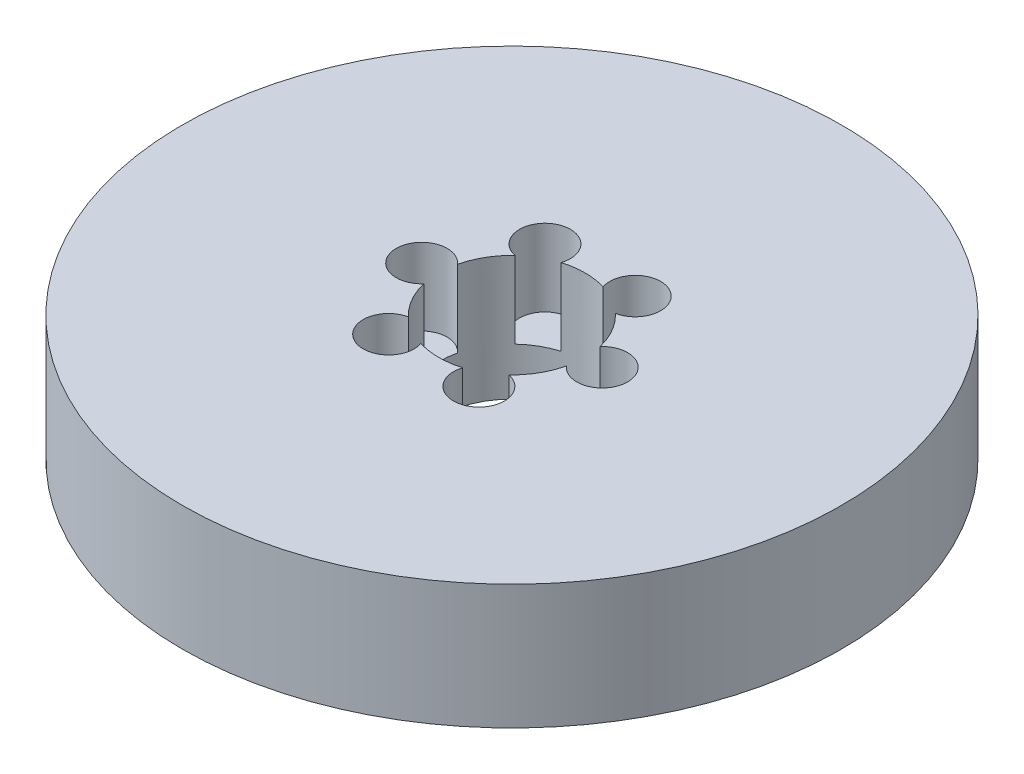
ISO-10303-21;
HEADER;
FILE_DESCRIPTION(('STEP AP214'),'2;1');
FILE_NAME('part.step','',(''),(''),'','','');
FILE_SCHEMA(('AUTOMOTIVE_DESIGN { 1 0 10303 214 1 1 1 1 }'));
ENDSEC;
DATA;
#1=APPLICATION_CONTEXT('core data for automotive mechanical design processes');
#2=APPLICATION_PROTOCOL_DEFINITION('international standard','automotive_design',2000,#1);
#3=PRODUCT_CONTEXT('',#1,'mechanical');
#4=PRODUCT('Part','Part','',(#3));
#5=PRODUCT_RELATED_PRODUCT_CATEGORY('part','',(#4));
#6=PRODUCT_DEFINITION_FORMATION('','',#4);
#7=PRODUCT_DEFINITION_CONTEXT('part definition',#1,'design');
#8=PRODUCT_DEFINITION('design','',#6,#7);
#9=PRODUCT_DEFINITION_SHAPE('','',#8);
#10=(LENGTH_UNIT() NAMED_UNIT(*) SI_UNIT(.MILLI.,.METRE.));
#11=(NAMED_UNIT(*) PLANE_ANGLE_UNIT() SI_UNIT($,.RADIAN.));
#12=(NAMED_UNIT(*) SI_UNIT($,.STERADIAN.) SOLID_ANGLE_UNIT());
#13=UNCERTAINTY_MEASURE_WITH_UNIT(LENGTH_MEASURE(1.E-05),#10,'distance_accuracy_value','');
#14=(GEOMETRIC_REPRESENTATION_CONTEXT(3) GLOBAL_UNCERTAINTY_ASSIGNED_CONTEXT((#13)) GLOBAL_UNIT_ASSIGNED_CONTEXT((#10,
#11,#12)) REPRESENTATION_CONTEXT('',''));
#15=CARTESIAN_POINT('',(0.,0.,0.));
#16=DIRECTION('',(0.,0.,1.));
#17=DIRECTION('',(1.,0.,0.));
#18=AXIS2_PLACEMENT_3D('',#15,#16,#17);
#19=CARTESIAN_POINT('',(0.,17.,0.));
#20=DIRECTION('',(0.,-1.,0.));
#21=DIRECTION('',(0.,0.,-1.));
#22=AXIS2_PLACEMENT_3D('',#19,#20,#21);
#23=CYLINDRICAL_SURFACE('',#22,45.);
#24=CARTESIAN_POINT('',(0.,17.,0.));
#25=DIRECTION('',(0.,1.,0.));
#26=DIRECTION('',(0.,0.,1.));
#27=AXIS2_PLACEMENT_3D('',#24,#25,#26);
#28=CIRCLE('',#27,45.);
#29=CARTESIAN_POINT('',(0.,17.,45.));
#30=VERTEX_POINT('',#29);
#31=EDGE_CURVE('E171',#30,#30,#28,.T.);
#32=ORIENTED_EDGE('',*,*,#31,.F.);
#33=EDGE_LOOP('',(#32));
#34=FACE_BOUND('',#33,.T.);
#35=CARTESIAN_POINT('',(0.,0.,0.));
#36=DIRECTION('',(0.,1.,0.));
#37=DIRECTION('',(0.,0.,1.));
#38=AXIS2_PLACEMENT_3D('',#35,#36,#37);
#39=CIRCLE('',#38,45.);
#40=CARTESIAN_POINT('',(0.,0.,45.));
#41=VERTEX_POINT('',#40);
#42=EDGE_CURVE('E157',#41,#41,#39,.T.);
#43=ORIENTED_EDGE('',*,*,#42,.T.);
#44=EDGE_LOOP('',(#43));
#45=FACE_BOUND('',#44,.T.);
#46=ADVANCED_FACE('F39',(#34,#45),#23,.T.);
#47=CARTESIAN_POINT('',(0.,17.,0.));
#48=DIRECTION('',(0.,1.,0.));
#49=DIRECTION('',(0.,0.,1.));
#50=AXIS2_PLACEMENT_3D('',#47,#48,#49);
#51=PLANE('',#50);
#52=CARTESIAN_POINT('',(-6.16183631469467,17.,-10.6726135649738));
#53=DIRECTION('',(0.,1.,0.));
#54=DIRECTION('',(-0.866025403784433,0.,0.50000000000001));
#55=AXIS2_PLACEMENT_3D('',#52,#53,#54);
#56=CIRCLE('',#55,3.47392098968232);
#57=CARTESIAN_POINT('',(-2.86383109224425,17.,-9.581151886652));
#58=VERTEX_POINT('',#57);
#59=CARTESIAN_POINT('',(-6.86560538523588,17.,-7.27072642135709));
#60=VERTEX_POINT('',#59);
#61=EDGE_CURVE('E214',#58,#60,#56,.T.);
#62=ORIENTED_EDGE('',*,*,#61,.F.);
#63=CARTESIAN_POINT('',(0.,17.,0.));
#64=DIRECTION('',(0.,1.,0.));
#65=DIRECTION('',(0.,0.,1.));
#66=AXIS2_PLACEMENT_3D('',#63,#64,#65);
#67=CIRCLE('',#66,10.);
#68=CARTESIAN_POINT('',(2.86383109224405,17.,-9.58115188665206));
#69=VERTEX_POINT('',#68);
#70=EDGE_CURVE('E272',#69,#58,#67,.T.);
#71=ORIENTED_EDGE('',*,*,#70,.F.);
#72=CARTESIAN_POINT('',(6.16183631469444,17.,-10.672613564974));
#73=DIRECTION('',(0.,1.,0.));
#74=DIRECTION('',(-0.866025403784443,0.,-0.499999999999992));
#75=AXIS2_PLACEMENT_3D('',#72,#73,#74);
#76=CIRCLE('',#75,3.47392098968232);
#77=CARTESIAN_POINT('',(6.86560538523573,17.,-7.27072642135724));
#78=VERTEX_POINT('',#77);
#79=EDGE_CURVE('E285',#78,#69,#76,.T.);
#80=ORIENTED_EDGE('',*,*,#79,.F.);
#81=CARTESIAN_POINT('',(9.72943647747993,17.,-2.31042546529485));
#82=VERTEX_POINT('',#81);
#83=EDGE_CURVE('E165',#82,#78,#67,.T.);
#84=ORIENTED_EDGE('',*,*,#83,.F.);
#85=CARTESIAN_POINT('',(12.3236726293891,17.,0.));
#86=DIRECTION('',(0.,1.,0.));
#87=DIRECTION('',(0.,0.,-1.));
#88=AXIS2_PLACEMENT_3D('',#85,#86,#87);
#89=CIRCLE('',#88,3.47392098968232);
#90=CARTESIAN_POINT('',(9.72943647747993,17.,2.31042546529485));
#91=VERTEX_POINT('',#90);
#92=EDGE_CURVE('E281',#91,#82,#89,.T.);
#93=ORIENTED_EDGE('',*,*,#92,.F.);
#94=CARTESIAN_POINT('',(6.86560538523582,17.,7.27072642135715));
#95=VERTEX_POINT('',#94);
#96=EDGE_CURVE('E160',#95,#91,#67,.T.);
#97=ORIENTED_EDGE('',*,*,#96,.F.);
#98=CARTESIAN_POINT('',(6.16183631469459,17.,10.6726135649739));
#99=DIRECTION('',(0.,1.,0.));
#100=DIRECTION('',(0.866025403784436,0.,-0.500000000000004));
#101=AXIS2_PLACEMENT_3D('',#98,#99,#100);
#102=CIRCLE('',#101,3.47392098968232);
#103=CARTESIAN_POINT('',(2.86383109224419,17.,9.58115188665202));
#104=VERTEX_POINT('',#103);
#105=EDGE_CURVE('E154',#104,#95,#102,.T.);
#106=ORIENTED_EDGE('',*,*,#105,.F.);
#107=CARTESIAN_POINT('',(-2.86383109224412,17.,9.58115188665203));
#108=VERTEX_POINT('',#107);
#109=EDGE_CURVE('E150',#108,#104,#67,.T.);
#110=ORIENTED_EDGE('',*,*,#109,.F.);
#111=CARTESIAN_POINT('',(-6.16183631469452,17.,10.6726135649739));
#112=DIRECTION('',(0.,1.,0.));
#113=DIRECTION('',(0.86602540378444,0.,0.499999999999998));
#114=AXIS2_PLACEMENT_3D('',#111,#112,#113);
#115=CIRCLE('',#114,3.47392098968232);
#116=CARTESIAN_POINT('',(-6.86560538523577,17.,7.27072642135719));
#117=VERTEX_POINT('',#116);
#118=EDGE_CURVE('E127',#117,#108,#115,.T.);
#119=ORIENTED_EDGE('',*,*,#118,.F.);
#120=CARTESIAN_POINT('',(-9.72943647747993,17.,2.31042546529485));
#121=VERTEX_POINT('',#120);
#122=EDGE_CURVE('E156',#121,#117,#67,.T.);
#123=ORIENTED_EDGE('',*,*,#122,.F.);
#124=CARTESIAN_POINT('',(-12.3236726293891,17.,0.));
#125=DIRECTION('',(0.,1.,0.));
#126=DIRECTION('',(0.,0.,1.));
#127=AXIS2_PLACEMENT_3D('',#124,#125,#126);
#128=CIRCLE('',#127,3.47392098968232);
#129=CARTESIAN_POINT('',(-9.72943647747993,17.,-2.31042546529485));
#130=VERTEX_POINT('',#129);
#131=EDGE_CURVE('E164',#130,#121,#128,.T.);
#132=ORIENTED_EDGE('',*,*,#131,.F.);
#133=EDGE_CURVE('E159',#60,#130,#67,.T.);
#134=ORIENTED_EDGE('',*,*,#133,.F.);
#135=EDGE_LOOP('',(#62,#71,#80,#84,#93,#97,#106,#110,#119,#123,#132,#134));
#136=FACE_BOUND('',#135,.T.);
#137=ORIENTED_EDGE('',*,*,#31,.T.);
#138=EDGE_LOOP('',(#137));
#139=FACE_BOUND('',#138,.T.);
#140=ADVANCED_FACE('F155',(#136,#139),#51,.T.);
#141=CARTESIAN_POINT('',(0.,0.,0.));
#142=DIRECTION('',(0.,1.,0.));
#143=DIRECTION('',(0.,0.,1.));
#144=AXIS2_PLACEMENT_3D('',#141,#142,#143);
#145=PLANE('',#144);
#146=CARTESIAN_POINT('',(0.,0.,0.));
#147=DIRECTION('',(0.,1.,0.));
#148=DIRECTION('',(0.,0.,1.));
#149=AXIS2_PLACEMENT_3D('',#146,#147,#148);
#150=CIRCLE('',#149,10.);
#151=CARTESIAN_POINT('',(0.,0.,10.));
#152=VERTEX_POINT('',#151);
#153=EDGE_CURVE('E170',#152,#152,#150,.T.);
#154=ORIENTED_EDGE('',*,*,#153,.T.);
#155=EDGE_LOOP('',(#154));
#156=FACE_BOUND('',#155,.T.);
#157=ORIENTED_EDGE('',*,*,#42,.F.);
#158=EDGE_LOOP('',(#157));
#159=FACE_BOUND('',#158,.T.);
#160=ADVANCED_FACE('F232',(#156,#159),#145,.F.);
#161=CARTESIAN_POINT('',(0.,17.,0.));
#162=DIRECTION('',(0.,-1.,0.));
#163=DIRECTION('',(0.,0.,-1.));
#164=AXIS2_PLACEMENT_3D('',#161,#162,#163);
#165=CYLINDRICAL_SURFACE('',#164,10.);
#166=DIRECTION('',(0.,1.,0.));
#167=VECTOR('',#166,1.);
#168=CARTESIAN_POINT('',(-2.86383109224425,11.752998474264,-9.581151886652));
#169=LINE('',#168,#167);
#170=CARTESIAN_POINT('',(-2.86383109224425,6.50599694852807,-9.581151886652));
#171=VERTEX_POINT('',#170);
#172=EDGE_CURVE('E11',#171,#58,#169,.T.);
#173=ORIENTED_EDGE('',*,*,#172,.F.);
#174=CARTESIAN_POINT('',(0.,6.50599694852807,0.));
#175=DIRECTION('',(0.,1.,0.));
#176=DIRECTION('',(0.,0.,1.));
#177=AXIS2_PLACEMENT_3D('',#174,#175,#176);
#178=CIRCLE('',#177,10.);
#179=CARTESIAN_POINT('',(-6.86560538523588,6.50599694852807,-7.27072642135709));
#180=VERTEX_POINT('',#179);
#181=EDGE_CURVE('E209',#171,#180,#178,.T.);
#182=ORIENTED_EDGE('',*,*,#181,.T.);
#183=DIRECTION('',(0.,1.,0.));
#184=VECTOR('',#183,1.);
#185=CARTESIAN_POINT('',(-6.86560538523587,11.752998474264,-7.27072642135709));
#186=LINE('',#185,#184);
#187=EDGE_CURVE('E46',#60,#180,#186,.F.);
#188=ORIENTED_EDGE('',*,*,#187,.F.);
#189=ORIENTED_EDGE('',*,*,#133,.T.);
#190=DIRECTION('',(0.,1.,0.));
#191=VECTOR('',#190,1.);
#192=CARTESIAN_POINT('',(-9.72943647747993,11.752998474264,-2.31042546529485));
#193=LINE('',#192,#191);
#194=CARTESIAN_POINT('',(-9.72943647747993,6.50599694852807,-2.31042546529485));
#195=VERTEX_POINT('',#194);
#196=EDGE_CURVE('E185',#195,#130,#193,.T.);
#197=ORIENTED_EDGE('',*,*,#196,.F.);
#198=CARTESIAN_POINT('',(0.,6.50599694852807,0.));
#199=DIRECTION('',(0.,1.,0.));
#200=DIRECTION('',(0.,0.,1.));
#201=AXIS2_PLACEMENT_3D('',#198,#199,#200);
#202=CIRCLE('',#201,10.);
#203=CARTESIAN_POINT('',(-9.72943647747993,6.50599694852807,2.31042546529485));
#204=VERTEX_POINT('',#203);
#205=EDGE_CURVE('E173',#195,#204,#202,.T.);
#206=ORIENTED_EDGE('',*,*,#205,.T.);
#207=DIRECTION('',(0.,1.,0.));
#208=VECTOR('',#207,1.);
#209=CARTESIAN_POINT('',(-9.72943647747993,11.752998474264,2.31042546529485));
#210=LINE('',#209,#208);
#211=EDGE_CURVE('E178',#121,#204,#210,.F.);
#212=ORIENTED_EDGE('',*,*,#211,.F.);
#213=ORIENTED_EDGE('',*,*,#122,.T.);
#214=DIRECTION('',(0.,1.,0.));
#215=VECTOR('',#214,1.);
#216=CARTESIAN_POINT('',(-6.86560538523577,11.752998474264,7.27072642135719));
#217=LINE('',#216,#215);
#218=CARTESIAN_POINT('',(-6.86560538523577,6.50599694852807,7.27072642135719));
#219=VERTEX_POINT('',#218);
#220=EDGE_CURVE('E132',#219,#117,#217,.T.);
#221=ORIENTED_EDGE('',*,*,#220,.F.);
#222=CARTESIAN_POINT('',(0.,6.50599694852807,0.));
#223=DIRECTION('',(0.,1.,0.));
#224=DIRECTION('',(0.,0.,1.));
#225=AXIS2_PLACEMENT_3D('',#222,#223,#224);
#226=CIRCLE('',#225,10.);
#227=CARTESIAN_POINT('',(-2.86383109224412,6.50599694852807,9.58115188665203));
#228=VERTEX_POINT('',#227);
#229=EDGE_CURVE('E146',#219,#228,#226,.T.);
#230=ORIENTED_EDGE('',*,*,#229,.T.);
#231=DIRECTION('',(0.,1.,0.));
#232=VECTOR('',#231,1.);
#233=CARTESIAN_POINT('',(-2.86383109224412,11.752998474264,9.58115188665204));
#234=LINE('',#233,#232);
#235=EDGE_CURVE('E128',#108,#228,#234,.F.);
#236=ORIENTED_EDGE('',*,*,#235,.F.);
#237=ORIENTED_EDGE('',*,*,#109,.T.);
#238=DIRECTION('',(0.,1.,0.));
#239=VECTOR('',#238,1.);
#240=CARTESIAN_POINT('',(2.86383109224418,11.752998474264,9.58115188665202));
#241=LINE('',#240,#239);
#242=CARTESIAN_POINT('',(2.86383109224419,6.50599694852807,9.58115188665202));
#243=VERTEX_POINT('',#242);
#244=EDGE_CURVE('E192',#243,#104,#241,.T.);
#245=ORIENTED_EDGE('',*,*,#244,.F.);
#246=CARTESIAN_POINT('',(0.,6.50599694852807,0.));
#247=DIRECTION('',(0.,1.,0.));
#248=DIRECTION('',(0.,0.,1.));
#249=AXIS2_PLACEMENT_3D('',#246,#247,#248);
#250=CIRCLE('',#249,10.);
#251=CARTESIAN_POINT('',(6.86560538523582,6.50599694852807,7.27072642135715));
#252=VERTEX_POINT('',#251);
#253=EDGE_CURVE('E190',#243,#252,#250,.T.);
#254=ORIENTED_EDGE('',*,*,#253,.T.);
#255=DIRECTION('',(0.,1.,0.));
#256=VECTOR('',#255,1.);
#257=CARTESIAN_POINT('',(6.86560538523582,11.752998474264,7.27072642135715));
#258=LINE('',#257,#256);
#259=EDGE_CURVE('E189',#95,#252,#258,.F.);
#260=ORIENTED_EDGE('',*,*,#259,.F.);
#261=ORIENTED_EDGE('',*,*,#96,.T.);
#262=DIRECTION('',(0.,1.,0.));
#263=VECTOR('',#262,1.);
#264=CARTESIAN_POINT('',(9.72943647747993,11.752998474264,2.31042546529485));
#265=LINE('',#264,#263);
#266=CARTESIAN_POINT('',(9.72943647747993,6.50599694852807,2.31042546529485));
#267=VERTEX_POINT('',#266);
#268=EDGE_CURVE('E203',#267,#91,#265,.T.);
#269=ORIENTED_EDGE('',*,*,#268,.F.);
#270=CARTESIAN_POINT('',(0.,6.50599694852807,0.));
#271=DIRECTION('',(0.,1.,0.));
#272=DIRECTION('',(0.,0.,1.));
#273=AXIS2_PLACEMENT_3D('',#270,#271,#272);
#274=CIRCLE('',#273,10.);
#275=CARTESIAN_POINT('',(9.72943647747993,6.50599694852807,-2.31042546529485));
#276=VERTEX_POINT('',#275);
#277=EDGE_CURVE('E194',#267,#276,#274,.T.);
#278=ORIENTED_EDGE('',*,*,#277,.T.);
#279=DIRECTION('',(0.,1.,0.));
#280=VECTOR('',#279,1.);
#281=CARTESIAN_POINT('',(9.72943647747993,11.752998474264,-2.31042546529485));
#282=LINE('',#281,#280);
#283=EDGE_CURVE('E196',#82,#276,#282,.F.);
#284=ORIENTED_EDGE('',*,*,#283,.F.);
#285=ORIENTED_EDGE('',*,*,#83,.T.);
#286=DIRECTION('',(0.,1.,0.));
#287=VECTOR('',#286,1.);
#288=CARTESIAN_POINT('',(6.86560538523572,11.752998474264,-7.27072642135724));
#289=LINE('',#288,#287);
#290=CARTESIAN_POINT('',(6.86560538523573,6.50599694852807,-7.27072642135724));
#291=VERTEX_POINT('',#290);
#292=EDGE_CURVE('E208',#291,#78,#289,.T.);
#293=ORIENTED_EDGE('',*,*,#292,.F.);
#294=CARTESIAN_POINT('',(0.,6.50599694852807,0.));
#295=DIRECTION('',(0.,1.,0.));
#296=DIRECTION('',(0.,0.,1.));
#297=AXIS2_PLACEMENT_3D('',#294,#295,#296);
#298=CIRCLE('',#297,10.);
#299=CARTESIAN_POINT('',(2.86383109224405,6.50599694852807,-9.58115188665206));
#300=VERTEX_POINT('',#299);
#301=EDGE_CURVE('E201',#291,#300,#298,.T.);
#302=ORIENTED_EDGE('',*,*,#301,.T.);
#303=DIRECTION('',(0.,1.,0.));
#304=VECTOR('',#303,1.);
#305=CARTESIAN_POINT('',(2.86383109224405,11.752998474264,-9.58115188665206));
#306=LINE('',#305,#304);
#307=EDGE_CURVE('E206',#69,#300,#306,.F.);
#308=ORIENTED_EDGE('',*,*,#307,.F.);
#309=ORIENTED_EDGE('',*,*,#70,.T.);
#310=EDGE_LOOP('',(#173,#182,#188,#189,#197,#206,#212,#213,#221,#230,#236,#237,#245,#254,#260,
#261,#269,#278,#284,#285,#293,#302,#308,#309));
#311=FACE_BOUND('',#310,.T.);
#312=ORIENTED_EDGE('',*,*,#153,.F.);
#313=EDGE_LOOP('',(#312));
#314=FACE_BOUND('',#313,.T.);
#315=ADVANCED_FACE('F145',(#311,#314),#165,.F.);
#316=CARTESIAN_POINT('',(-12.3236726293891,6.50599694852807,0.));
#317=DIRECTION('',(0.,1.,0.));
#318=DIRECTION('',(0.,0.,1.));
#319=AXIS2_PLACEMENT_3D('',#316,#317,#318);
#320=CYLINDRICAL_SURFACE('',#319,3.47392098968232);
#321=ORIENTED_EDGE('',*,*,#196,.T.);
#322=ORIENTED_EDGE('',*,*,#131,.T.);
#323=ORIENTED_EDGE('',*,*,#211,.T.);
#324=CARTESIAN_POINT('',(-12.3236726293891,6.50599694852807,0.));
#325=DIRECTION('',(0.,1.,0.));
#326=DIRECTION('',(0.,0.,1.));
#327=AXIS2_PLACEMENT_3D('',#324,#325,#326);
#328=CIRCLE('',#327,3.47392098968232);
#329=EDGE_CURVE('E168',#195,#204,#328,.T.);
#330=ORIENTED_EDGE('',*,*,#329,.F.);
#331=EDGE_LOOP('',(#321,#322,#323,#330));
#332=FACE_BOUND('',#331,.T.);
#333=ADVANCED_FACE('F243',(#332),#320,.F.);
#334=CARTESIAN_POINT('',(-12.3236726293891,6.50599694852807,0.));
#335=DIRECTION('',(0.,1.,0.));
#336=DIRECTION('',(0.,0.,1.));
#337=AXIS2_PLACEMENT_3D('',#334,#335,#336);
#338=PLANE('',#337);
#339=ORIENTED_EDGE('',*,*,#329,.T.);
#340=ORIENTED_EDGE('',*,*,#205,.F.);
#341=EDGE_LOOP('',(#339,#340));
#342=FACE_BOUND('',#341,.T.);
#343=ADVANCED_FACE('F247',(#342),#338,.T.);
#344=CARTESIAN_POINT('',(-6.16183631469452,6.50599694852807,10.6726135649739));
#345=DIRECTION('',(0.,1.,0.));
#346=DIRECTION('',(0.,0.,1.));
#347=AXIS2_PLACEMENT_3D('',#344,#345,#346);
#348=CYLINDRICAL_SURFACE('',#347,3.47392098968232);
#349=ORIENTED_EDGE('',*,*,#220,.T.);
#350=ORIENTED_EDGE('',*,*,#118,.T.);
#351=ORIENTED_EDGE('',*,*,#235,.T.);
#352=CARTESIAN_POINT('',(-6.16183631469452,6.50599694852807,10.6726135649739));
#353=DIRECTION('',(0.,1.,0.));
#354=DIRECTION('',(0.86602540378444,0.,0.499999999999998));
#355=AXIS2_PLACEMENT_3D('',#352,#353,#354);
#356=CIRCLE('',#355,3.47392098968232);
#357=EDGE_CURVE('E137',#219,#228,#356,.T.);
#358=ORIENTED_EDGE('',*,*,#357,.F.);
#359=EDGE_LOOP('',(#349,#350,#351,#358));
#360=FACE_BOUND('',#359,.T.);
#361=ADVANCED_FACE('F126',(#360),#348,.F.);
#362=CARTESIAN_POINT('',(-6.16183631469452,6.50599694852807,10.6726135649739));
#363=DIRECTION('',(0.,1.,0.));
#364=DIRECTION('',(0.86602540378444,0.,0.499999999999998));
#365=AXIS2_PLACEMENT_3D('',#362,#363,#364);
#366=PLANE('',#365);
#367=ORIENTED_EDGE('',*,*,#357,.T.);
#368=ORIENTED_EDGE('',*,*,#229,.F.);
#369=EDGE_LOOP('',(#367,#368));
#370=FACE_BOUND('',#369,.T.);
#371=ADVANCED_FACE('F254',(#370),#366,.T.);
#372=CARTESIAN_POINT('',(6.16183631469459,6.50599694852807,10.6726135649739));
#373=DIRECTION('',(0.,1.,0.));
#374=DIRECTION('',(0.,0.,1.));
#375=AXIS2_PLACEMENT_3D('',#372,#373,#374);
#376=CYLINDRICAL_SURFACE('',#375,3.47392098968232);
#377=ORIENTED_EDGE('',*,*,#244,.T.);
#378=ORIENTED_EDGE('',*,*,#105,.T.);
#379=ORIENTED_EDGE('',*,*,#259,.T.);
#380=CARTESIAN_POINT('',(6.16183631469459,6.50599694852807,10.6726135649739));
#381=DIRECTION('',(0.,1.,0.));
#382=DIRECTION('',(0.866025403784436,0.,-0.500000000000004));
#383=AXIS2_PLACEMENT_3D('',#380,#381,#382);
#384=CIRCLE('',#383,3.47392098968232);
#385=EDGE_CURVE('E138',#243,#252,#384,.T.);
#386=ORIENTED_EDGE('',*,*,#385,.F.);
#387=EDGE_LOOP('',(#377,#378,#379,#386));
#388=FACE_BOUND('',#387,.T.);
#389=ADVANCED_FACE('F260',(#388),#376,.F.);
#390=CARTESIAN_POINT('',(6.16183631469459,6.50599694852807,10.6726135649739));
#391=DIRECTION('',(0.,1.,0.));
#392=DIRECTION('',(0.866025403784436,0.,-0.500000000000004));
#393=AXIS2_PLACEMENT_3D('',#390,#391,#392);
#394=PLANE('',#393);
#395=ORIENTED_EDGE('',*,*,#385,.T.);
#396=ORIENTED_EDGE('',*,*,#253,.F.);
#397=EDGE_LOOP('',(#395,#396));
#398=FACE_BOUND('',#397,.T.);
#399=ADVANCED_FACE('F265',(#398),#394,.T.);
#400=CARTESIAN_POINT('',(12.3236726293891,6.50599694852807,0.));
#401=DIRECTION('',(0.,1.,0.));
#402=DIRECTION('',(0.,0.,1.));
#403=AXIS2_PLACEMENT_3D('',#400,#401,#402);
#404=CYLINDRICAL_SURFACE('',#403,3.47392098968232);
#405=ORIENTED_EDGE('',*,*,#268,.T.);
#406=ORIENTED_EDGE('',*,*,#92,.T.);
#407=ORIENTED_EDGE('',*,*,#283,.T.);
#408=CARTESIAN_POINT('',(12.3236726293891,6.50599694852807,0.));
#409=DIRECTION('',(0.,1.,0.));
#410=DIRECTION('',(0.,0.,-1.));
#411=AXIS2_PLACEMENT_3D('',#408,#409,#410);
#412=CIRCLE('',#411,3.47392098968232);
#413=EDGE_CURVE('E287',#267,#276,#412,.T.);
#414=ORIENTED_EDGE('',*,*,#413,.F.);
#415=EDGE_LOOP('',(#405,#406,#407,#414));
#416=FACE_BOUND('',#415,.T.);
#417=ADVANCED_FACE('F300',(#416),#404,.F.);
#418=CARTESIAN_POINT('',(12.3236726293891,6.50599694852807,0.));
#419=DIRECTION('',(0.,1.,0.));
#420=DIRECTION('',(0.,0.,-1.));
#421=AXIS2_PLACEMENT_3D('',#418,#419,#420);
#422=PLANE('',#421);
#423=ORIENTED_EDGE('',*,*,#413,.T.);
#424=ORIENTED_EDGE('',*,*,#277,.F.);
#425=EDGE_LOOP('',(#423,#424));
#426=FACE_BOUND('',#425,.T.);
#427=ADVANCED_FACE('F298',(#426),#422,.T.);
#428=CARTESIAN_POINT('',(6.16183631469444,6.50599694852807,-10.672613564974));
#429=DIRECTION('',(0.,1.,0.));
#430=DIRECTION('',(0.,0.,1.));
#431=AXIS2_PLACEMENT_3D('',#428,#429,#430);
#432=CYLINDRICAL_SURFACE('',#431,3.47392098968232);
#433=ORIENTED_EDGE('',*,*,#292,.T.);
#434=ORIENTED_EDGE('',*,*,#79,.T.);
#435=ORIENTED_EDGE('',*,*,#307,.T.);
#436=CARTESIAN_POINT('',(6.16183631469444,6.50599694852807,-10.672613564974));
#437=DIRECTION('',(0.,1.,0.));
#438=DIRECTION('',(-0.866025403784443,0.,-0.499999999999992));
#439=AXIS2_PLACEMENT_3D('',#436,#437,#438);
#440=CIRCLE('',#439,3.47392098968232);
#441=EDGE_CURVE('E56',#291,#300,#440,.T.);
#442=ORIENTED_EDGE('',*,*,#441,.F.);
#443=EDGE_LOOP('',(#433,#434,#435,#442));
#444=FACE_BOUND('',#443,.T.);
#445=ADVANCED_FACE('F301',(#444),#432,.F.);
#446=CARTESIAN_POINT('',(6.16183631469444,6.50599694852807,-10.672613564974));
#447=DIRECTION('',(0.,1.,0.));
#448=DIRECTION('',(-0.866025403784443,0.,-0.499999999999992));
#449=AXIS2_PLACEMENT_3D('',#446,#447,#448);
#450=PLANE('',#449);
#451=ORIENTED_EDGE('',*,*,#441,.T.);
#452=ORIENTED_EDGE('',*,*,#301,.F.);
#453=EDGE_LOOP('',(#451,#452));
#454=FACE_BOUND('',#453,.T.);
#455=ADVANCED_FACE('F221',(#454),#450,.T.);
#456=CARTESIAN_POINT('',(-6.16183631469467,6.50599694852807,-10.6726135649738));
#457=DIRECTION('',(0.,1.,0.));
#458=DIRECTION('',(0.,0.,1.));
#459=AXIS2_PLACEMENT_3D('',#456,#457,#458);
#460=CYLINDRICAL_SURFACE('',#459,3.47392098968232);
#461=ORIENTED_EDGE('',*,*,#172,.T.);
#462=ORIENTED_EDGE('',*,*,#61,.T.);
#463=ORIENTED_EDGE('',*,*,#187,.T.);
#464=CARTESIAN_POINT('',(-6.16183631469467,6.50599694852807,-10.6726135649738));
#465=DIRECTION('',(0.,1.,0.));
#466=DIRECTION('',(-0.866025403784433,0.,0.50000000000001));
#467=AXIS2_PLACEMENT_3D('',#464,#465,#466);
#468=CIRCLE('',#467,3.47392098968232);
#469=EDGE_CURVE('E55',#171,#180,#468,.T.);
#470=ORIENTED_EDGE('',*,*,#469,.F.);
#471=EDGE_LOOP('',(#461,#462,#463,#470));
#472=FACE_BOUND('',#471,.T.);
#473=ADVANCED_FACE('F212',(#472),#460,.F.);
#474=CARTESIAN_POINT('',(-6.16183631469467,6.50599694852807,-10.6726135649738));
#475=DIRECTION('',(0.,1.,0.));
#476=DIRECTION('',(-0.866025403784433,0.,0.50000000000001));
#477=AXIS2_PLACEMENT_3D('',#474,#475,#476);
#478=PLANE('',#477);
#479=ORIENTED_EDGE('',*,*,#469,.T.);
#480=ORIENTED_EDGE('',*,*,#181,.F.);
#481=EDGE_LOOP('',(#479,#480));
#482=FACE_BOUND('',#481,.T.);
#483=ADVANCED_FACE('F217',(#482),#478,.T.);
#484=CLOSED_SHELL('',(#46,#140,#160,#315,#333,#343,#361,#371,#389,#399,#417,#427,#445,#455,#473,#483));
#485=MANIFOLD_SOLID_BREP('B2',#484);
#486=ADVANCED_BREP_SHAPE_REPRESENTATION('',(#18,#485),#14);
#487=SHAPE_DEFINITION_REPRESENTATION(#9,#486);
ENDSEC;
END-ISO-10303-21;
